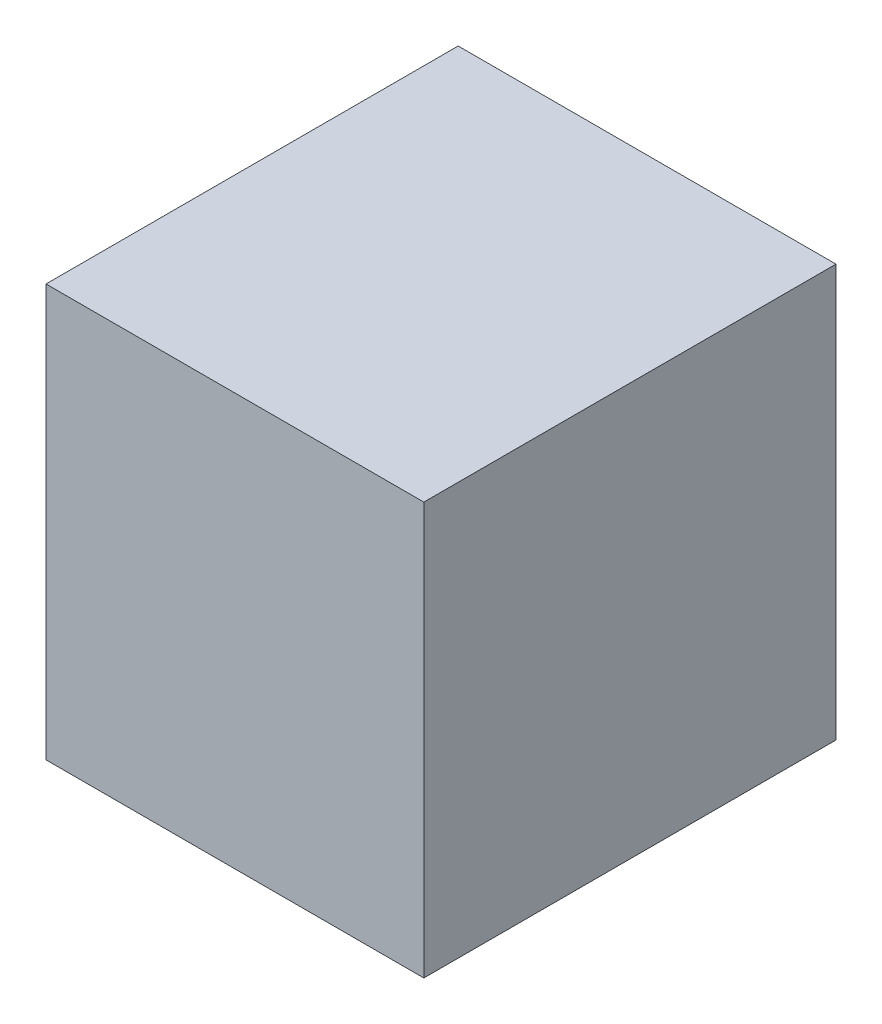
ISO-10303-21;
HEADER;
FILE_DESCRIPTION(('STEP AP214'),'2;1');
FILE_NAME('part.step','',(''),(''),'','','');
FILE_SCHEMA(('AUTOMOTIVE_DESIGN { 1 0 10303 214 1 1 1 1 }'));
ENDSEC;
DATA;
#1=APPLICATION_CONTEXT('core data for automotive mechanical design processes');
#2=APPLICATION_PROTOCOL_DEFINITION('international standard','automotive_design',2000,#1);
#3=PRODUCT_CONTEXT('',#1,'mechanical');
#4=PRODUCT('Part','Part','',(#3));
#5=PRODUCT_RELATED_PRODUCT_CATEGORY('part','',(#4));
#6=PRODUCT_DEFINITION_FORMATION('','',#4);
#7=PRODUCT_DEFINITION_CONTEXT('part definition',#1,'design');
#8=PRODUCT_DEFINITION('design','',#6,#7);
#9=PRODUCT_DEFINITION_SHAPE('','',#8);
#10=(LENGTH_UNIT() NAMED_UNIT(*) SI_UNIT(.MILLI.,.METRE.));
#11=(NAMED_UNIT(*) PLANE_ANGLE_UNIT() SI_UNIT($,.RADIAN.));
#12=(NAMED_UNIT(*) SI_UNIT($,.STERADIAN.) SOLID_ANGLE_UNIT());
#13=UNCERTAINTY_MEASURE_WITH_UNIT(LENGTH_MEASURE(1.E-05),#10,'distance_accuracy_value','');
#14=(GEOMETRIC_REPRESENTATION_CONTEXT(3) GLOBAL_UNCERTAINTY_ASSIGNED_CONTEXT((#13)) GLOBAL_UNIT_ASSIGNED_CONTEXT((#10,
#11,#12)) REPRESENTATION_CONTEXT('',''));
#15=CARTESIAN_POINT('',(0.,0.,0.));
#16=DIRECTION('',(0.,0.,1.));
#17=DIRECTION('',(1.,0.,0.));
#18=AXIS2_PLACEMENT_3D('',#15,#16,#17);
#19=CARTESIAN_POINT('',(0.,0.,600.));
#20=DIRECTION('',(-1.,0.,0.));
#21=DIRECTION('',(0.,0.,1.));
#22=AXIS2_PLACEMENT_3D('',#19,#20,#21);
#23=PLANE('',#22);
#24=DIRECTION('',(0.,1.,0.));
#25=VECTOR('',#24,1.);
#26=CARTESIAN_POINT('',(0.,0.,0.));
#27=LINE('',#26,#25);
#28=CARTESIAN_POINT('',(0.,0.,0.));
#29=VERTEX_POINT('',#28);
#30=CARTESIAN_POINT('',(0.,600.,0.));
#31=VERTEX_POINT('',#30);
#32=EDGE_CURVE('E98',#29,#31,#27,.T.);
#33=ORIENTED_EDGE('',*,*,#32,.T.);
#34=DIRECTION('',(0.,0.,-1.));
#35=VECTOR('',#34,1.);
#36=CARTESIAN_POINT('',(0.,600.,600.));
#37=LINE('',#36,#35);
#38=CARTESIAN_POINT('',(0.,600.,600.));
#39=VERTEX_POINT('',#38);
#40=EDGE_CURVE('E11',#39,#31,#37,.T.);
#41=ORIENTED_EDGE('',*,*,#40,.F.);
#42=DIRECTION('',(0.,1.,0.));
#43=VECTOR('',#42,1.);
#44=CARTESIAN_POINT('',(0.,0.,600.));
#45=LINE('',#44,#43);
#46=CARTESIAN_POINT('',(0.,0.,600.));
#47=VERTEX_POINT('',#46);
#48=EDGE_CURVE('E86',#47,#39,#45,.T.);
#49=ORIENTED_EDGE('',*,*,#48,.F.);
#50=DIRECTION('',(0.,0.,-1.));
#51=VECTOR('',#50,1.);
#52=CARTESIAN_POINT('',(0.,0.,600.));
#53=LINE('',#52,#51);
#54=EDGE_CURVE('E94',#47,#29,#53,.T.);
#55=ORIENTED_EDGE('',*,*,#54,.T.);
#56=EDGE_LOOP('',(#33,#41,#49,#55));
#57=FACE_BOUND('',#56,.T.);
#58=ADVANCED_FACE('F35',(#57),#23,.F.);
#59=CARTESIAN_POINT('',(0.,600.,600.));
#60=DIRECTION('',(0.,-1.,0.));
#61=DIRECTION('',(1.,0.,0.));
#62=AXIS2_PLACEMENT_3D('',#59,#60,#61);
#63=PLANE('',#62);
#64=DIRECTION('',(-1.,0.,0.));
#65=VECTOR('',#64,1.);
#66=CARTESIAN_POINT('',(0.,600.,0.));
#67=LINE('',#66,#65);
#68=CARTESIAN_POINT('',(-550.,600.,0.));
#69=VERTEX_POINT('',#68);
#70=EDGE_CURVE('E90',#31,#69,#67,.T.);
#71=ORIENTED_EDGE('',*,*,#70,.T.);
#72=DIRECTION('',(0.,0.,-1.));
#73=VECTOR('',#72,1.);
#74=CARTESIAN_POINT('',(-550.,600.,600.));
#75=LINE('',#74,#73);
#76=CARTESIAN_POINT('',(-550.,600.,600.));
#77=VERTEX_POINT('',#76);
#78=EDGE_CURVE('E43',#77,#69,#75,.T.);
#79=ORIENTED_EDGE('',*,*,#78,.F.);
#80=DIRECTION('',(-1.,0.,0.));
#81=VECTOR('',#80,1.);
#82=CARTESIAN_POINT('',(0.,600.,600.));
#83=LINE('',#82,#81);
#84=EDGE_CURVE('E81',#39,#77,#83,.T.);
#85=ORIENTED_EDGE('',*,*,#84,.F.);
#86=ORIENTED_EDGE('',*,*,#40,.T.);
#87=EDGE_LOOP('',(#71,#79,#85,#86));
#88=FACE_BOUND('',#87,.T.);
#89=ADVANCED_FACE('F89',(#88),#63,.F.);
#90=CARTESIAN_POINT('',(-550.,0.,600.));
#91=DIRECTION('',(1.,0.,0.));
#92=DIRECTION('',(0.,0.,-1.));
#93=AXIS2_PLACEMENT_3D('',#90,#91,#92);
#94=PLANE('',#93);
#95=DIRECTION('',(0.,-1.,0.));
#96=VECTOR('',#95,1.);
#97=CARTESIAN_POINT('',(-550.,0.,0.));
#98=LINE('',#97,#96);
#99=CARTESIAN_POINT('',(-550.,0.,0.));
#100=VERTEX_POINT('',#99);
#101=EDGE_CURVE('E68',#69,#100,#98,.T.);
#102=ORIENTED_EDGE('',*,*,#101,.T.);
#103=DIRECTION('',(0.,0.,-1.));
#104=VECTOR('',#103,1.);
#105=CARTESIAN_POINT('',(-550.,0.,600.));
#106=LINE('',#105,#104);
#107=CARTESIAN_POINT('',(-550.,0.,600.));
#108=VERTEX_POINT('',#107);
#109=EDGE_CURVE('E91',#108,#100,#106,.T.);
#110=ORIENTED_EDGE('',*,*,#109,.F.);
#111=DIRECTION('',(0.,-1.,0.));
#112=VECTOR('',#111,1.);
#113=CARTESIAN_POINT('',(-550.,0.,600.));
#114=LINE('',#113,#112);
#115=EDGE_CURVE('E84',#77,#108,#114,.T.);
#116=ORIENTED_EDGE('',*,*,#115,.F.);
#117=ORIENTED_EDGE('',*,*,#78,.T.);
#118=EDGE_LOOP('',(#102,#110,#116,#117));
#119=FACE_BOUND('',#118,.T.);
#120=ADVANCED_FACE('F92',(#119),#94,.F.);
#121=CARTESIAN_POINT('',(0.,0.,600.));
#122=DIRECTION('',(0.,1.,0.));
#123=DIRECTION('',(-1.,0.,0.));
#124=AXIS2_PLACEMENT_3D('',#121,#122,#123);
#125=PLANE('',#124);
#126=DIRECTION('',(1.,0.,0.));
#127=VECTOR('',#126,1.);
#128=CARTESIAN_POINT('',(0.,0.,0.));
#129=LINE('',#128,#127);
#130=EDGE_CURVE('E74',#100,#29,#129,.T.);
#131=ORIENTED_EDGE('',*,*,#130,.T.);
#132=ORIENTED_EDGE('',*,*,#54,.F.);
#133=DIRECTION('',(1.,0.,0.));
#134=VECTOR('',#133,1.);
#135=CARTESIAN_POINT('',(0.,0.,600.));
#136=LINE('',#135,#134);
#137=EDGE_CURVE('E51',#108,#47,#136,.T.);
#138=ORIENTED_EDGE('',*,*,#137,.F.);
#139=ORIENTED_EDGE('',*,*,#109,.T.);
#140=EDGE_LOOP('',(#131,#132,#138,#139));
#141=FACE_BOUND('',#140,.T.);
#142=ADVANCED_FACE('F105',(#141),#125,.F.);
#143=CARTESIAN_POINT('',(0.,0.,600.));
#144=DIRECTION('',(0.,0.,1.));
#145=DIRECTION('',(1.,0.,0.));
#146=AXIS2_PLACEMENT_3D('',#143,#144,#145);
#147=PLANE('',#146);
#148=ORIENTED_EDGE('',*,*,#48,.T.);
#149=ORIENTED_EDGE('',*,*,#84,.T.);
#150=ORIENTED_EDGE('',*,*,#115,.T.);
#151=ORIENTED_EDGE('',*,*,#137,.T.);
#152=EDGE_LOOP('',(#148,#149,#150,#151));
#153=FACE_BOUND('',#152,.T.);
#154=ADVANCED_FACE('F82',(#153),#147,.T.);
#155=CARTESIAN_POINT('',(0.,0.,0.));
#156=DIRECTION('',(0.,0.,1.));
#157=DIRECTION('',(1.,0.,0.));
#158=AXIS2_PLACEMENT_3D('',#155,#156,#157);
#159=PLANE('',#158);
#160=ORIENTED_EDGE('',*,*,#32,.F.);
#161=ORIENTED_EDGE('',*,*,#130,.F.);
#162=ORIENTED_EDGE('',*,*,#101,.F.);
#163=ORIENTED_EDGE('',*,*,#70,.F.);
#164=EDGE_LOOP('',(#160,#161,#162,#163));
#165=FACE_BOUND('',#164,.T.);
#166=ADVANCED_FACE('F108',(#165),#159,.F.);
#167=CLOSED_SHELL('',(#58,#89,#120,#142,#154,#166));
#168=MANIFOLD_SOLID_BREP('B2',#167);
#169=ADVANCED_BREP_SHAPE_REPRESENTATION('',(#18,#168),#14);
#170=SHAPE_DEFINITION_REPRESENTATION(#9,#169);
ENDSEC;
END-ISO-10303-21;
